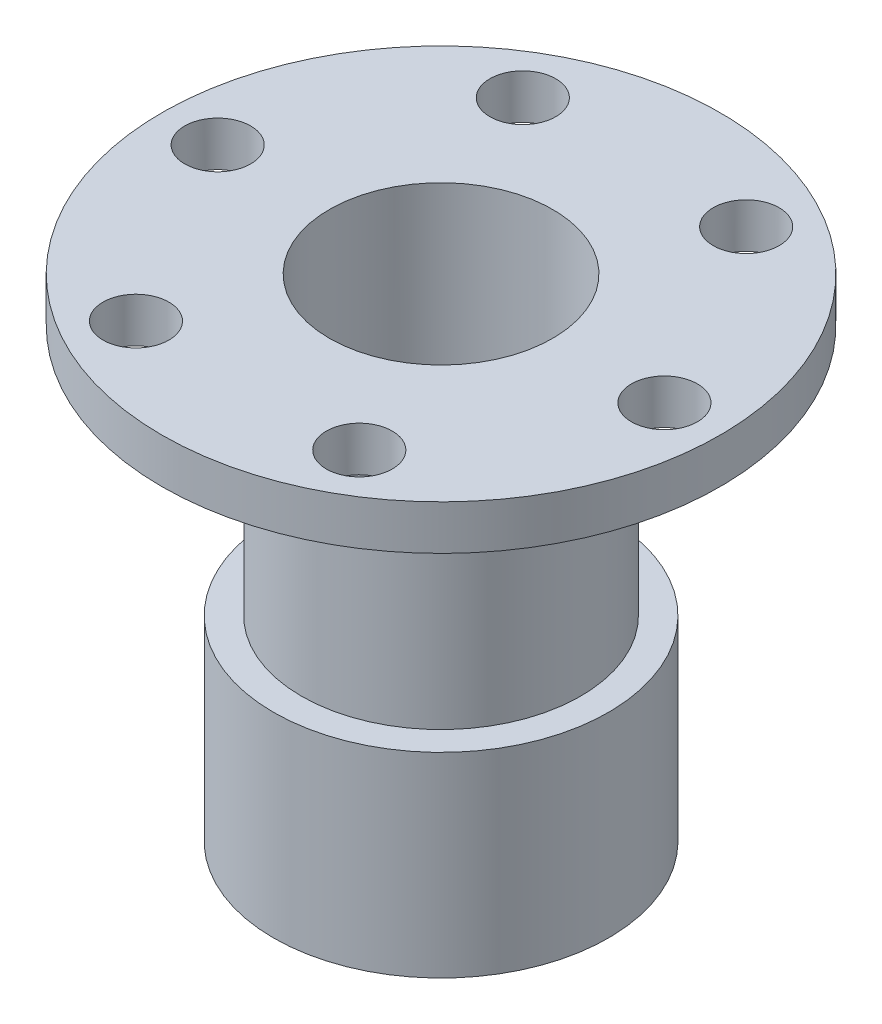
ISO-10303-21;
HEADER;
FILE_DESCRIPTION(('STEP AP214'),'2;1');
FILE_NAME('part.step','',(''),(''),'','','');
FILE_SCHEMA(('AUTOMOTIVE_DESIGN { 1 0 10303 214 1 1 1 1 }'));
ENDSEC;
DATA;
#1=APPLICATION_CONTEXT('core data for automotive mechanical design processes');
#2=APPLICATION_PROTOCOL_DEFINITION('international standard','automotive_design',2000,#1);
#3=PRODUCT_CONTEXT('',#1,'mechanical');
#4=PRODUCT('Part','Part','',(#3));
#5=PRODUCT_RELATED_PRODUCT_CATEGORY('part','',(#4));
#6=PRODUCT_DEFINITION_FORMATION('','',#4);
#7=PRODUCT_DEFINITION_CONTEXT('part definition',#1,'design');
#8=PRODUCT_DEFINITION('design','',#6,#7);
#9=PRODUCT_DEFINITION_SHAPE('','',#8);
#10=(LENGTH_UNIT() NAMED_UNIT(*) SI_UNIT(.MILLI.,.METRE.));
#11=(NAMED_UNIT(*) PLANE_ANGLE_UNIT() SI_UNIT($,.RADIAN.));
#12=(NAMED_UNIT(*) SI_UNIT($,.STERADIAN.) SOLID_ANGLE_UNIT());
#13=UNCERTAINTY_MEASURE_WITH_UNIT(LENGTH_MEASURE(1.E-05),#10,'distance_accuracy_value','');
#14=(GEOMETRIC_REPRESENTATION_CONTEXT(3) GLOBAL_UNCERTAINTY_ASSIGNED_CONTEXT((#13)) GLOBAL_UNIT_ASSIGNED_CONTEXT((#10,
#11,#12)) REPRESENTATION_CONTEXT('',''));
#15=CARTESIAN_POINT('',(0.,0.,0.));
#16=DIRECTION('',(0.,0.,1.));
#17=DIRECTION('',(1.,0.,0.));
#18=AXIS2_PLACEMENT_3D('',#15,#16,#17);
#19=CARTESIAN_POINT('',(0.,35.,0.));
#20=DIRECTION('',(0.,-1.,0.));
#21=DIRECTION('',(0.,0.,-1.));
#22=AXIS2_PLACEMENT_3D('',#19,#20,#21);
#23=CYLINDRICAL_SURFACE('',#22,30.);
#24=CARTESIAN_POINT('',(0.,35.,0.));
#25=DIRECTION('',(0.,1.,0.));
#26=DIRECTION('',(0.,0.,1.));
#27=AXIS2_PLACEMENT_3D('',#24,#25,#26);
#28=CIRCLE('',#27,30.);
#29=CARTESIAN_POINT('',(0.,35.,30.));
#30=VERTEX_POINT('',#29);
#31=EDGE_CURVE('E10',#30,#30,#28,.T.);
#32=ORIENTED_EDGE('',*,*,#31,.F.);
#33=EDGE_LOOP('',(#32));
#34=FACE_BOUND('',#33,.T.);
#35=CARTESIAN_POINT('',(0.,0.,0.));
#36=DIRECTION('',(0.,1.,0.));
#37=DIRECTION('',(0.,0.,1.));
#38=AXIS2_PLACEMENT_3D('',#35,#36,#37);
#39=CIRCLE('',#38,30.);
#40=CARTESIAN_POINT('',(0.,0.,30.));
#41=VERTEX_POINT('',#40);
#42=EDGE_CURVE('E40',#41,#41,#39,.T.);
#43=ORIENTED_EDGE('',*,*,#42,.T.);
#44=EDGE_LOOP('',(#43));
#45=FACE_BOUND('',#44,.T.);
#46=ADVANCED_FACE('F33',(#34,#45),#23,.T.);
#47=CARTESIAN_POINT('',(0.,35.,0.));
#48=DIRECTION('',(0.,1.,0.));
#49=DIRECTION('',(0.,0.,1.));
#50=AXIS2_PLACEMENT_3D('',#47,#48,#49);
#51=PLANE('',#50);
#52=CARTESIAN_POINT('',(0.,35.,0.));
#53=DIRECTION('',(0.,1.,0.));
#54=DIRECTION('',(0.,0.,1.));
#55=AXIS2_PLACEMENT_3D('',#52,#53,#54);
#56=CIRCLE('',#55,25.);
#57=CARTESIAN_POINT('',(0.,35.,25.));
#58=VERTEX_POINT('',#57);
#59=EDGE_CURVE('E48',#58,#58,#56,.T.);
#60=ORIENTED_EDGE('',*,*,#59,.F.);
#61=EDGE_LOOP('',(#60));
#62=FACE_BOUND('',#61,.T.);
#63=ORIENTED_EDGE('',*,*,#31,.T.);
#64=EDGE_LOOP('',(#63));
#65=FACE_BOUND('',#64,.T.);
#66=ADVANCED_FACE('F107',(#62,#65),#51,.T.);
#67=CARTESIAN_POINT('',(0.,0.,0.));
#68=DIRECTION('',(0.,1.,0.));
#69=DIRECTION('',(0.,0.,1.));
#70=AXIS2_PLACEMENT_3D('',#67,#68,#69);
#71=PLANE('',#70);
#72=CARTESIAN_POINT('',(0.,0.,0.));
#73=DIRECTION('',(0.,-1.,0.));
#74=DIRECTION('',(0.,0.,-1.));
#75=AXIS2_PLACEMENT_3D('',#72,#73,#74);
#76=CIRCLE('',#75,25.);
#77=CARTESIAN_POINT('',(0.,0.,-25.));
#78=VERTEX_POINT('',#77);
#79=EDGE_CURVE('E86',#78,#78,#76,.T.);
#80=ORIENTED_EDGE('',*,*,#79,.F.);
#81=EDGE_LOOP('',(#80));
#82=FACE_BOUND('',#81,.T.);
#83=ORIENTED_EDGE('',*,*,#42,.F.);
#84=EDGE_LOOP('',(#83));
#85=FACE_BOUND('',#84,.T.);
#86=ADVANCED_FACE('F109',(#82,#85),#71,.F.);
#87=CARTESIAN_POINT('',(0.,80.,0.));
#88=DIRECTION('',(0.,-1.,0.));
#89=DIRECTION('',(0.,0.,-1.));
#90=AXIS2_PLACEMENT_3D('',#87,#88,#89);
#91=CYLINDRICAL_SURFACE('',#90,25.);
#92=CARTESIAN_POINT('',(0.,80.,0.));
#93=DIRECTION('',(0.,1.,0.));
#94=DIRECTION('',(0.,0.,1.));
#95=AXIS2_PLACEMENT_3D('',#92,#93,#94);
#96=CIRCLE('',#95,25.);
#97=CARTESIAN_POINT('',(0.,80.,25.));
#98=VERTEX_POINT('',#97);
#99=EDGE_CURVE('E45',#98,#98,#96,.T.);
#100=ORIENTED_EDGE('',*,*,#99,.F.);
#101=EDGE_LOOP('',(#100));
#102=FACE_BOUND('',#101,.T.);
#103=ORIENTED_EDGE('',*,*,#59,.T.);
#104=EDGE_LOOP('',(#103));
#105=FACE_BOUND('',#104,.T.);
#106=ADVANCED_FACE('F105',(#102,#105),#91,.T.);
#107=CARTESIAN_POINT('',(0.,88.,0.));
#108=DIRECTION('',(0.,-1.,0.));
#109=DIRECTION('',(0.,0.,-1.));
#110=AXIS2_PLACEMENT_3D('',#107,#108,#109);
#111=CYLINDRICAL_SURFACE('',#110,50.);
#112=CARTESIAN_POINT('',(0.,88.,0.));
#113=DIRECTION('',(0.,1.,0.));
#114=DIRECTION('',(0.,0.,1.));
#115=AXIS2_PLACEMENT_3D('',#112,#113,#114);
#116=CIRCLE('',#115,50.);
#117=CARTESIAN_POINT('',(0.,88.,50.));
#118=VERTEX_POINT('',#117);
#119=EDGE_CURVE('E95',#118,#118,#116,.T.);
#120=ORIENTED_EDGE('',*,*,#119,.F.);
#121=EDGE_LOOP('',(#120));
#122=FACE_BOUND('',#121,.T.);
#123=CARTESIAN_POINT('',(0.,80.,0.));
#124=DIRECTION('',(0.,1.,0.));
#125=DIRECTION('',(0.,0.,1.));
#126=AXIS2_PLACEMENT_3D('',#123,#124,#125);
#127=CIRCLE('',#126,50.);
#128=CARTESIAN_POINT('',(0.,80.,50.));
#129=VERTEX_POINT('',#128);
#130=EDGE_CURVE('E92',#129,#129,#127,.T.);
#131=ORIENTED_EDGE('',*,*,#130,.T.);
#132=EDGE_LOOP('',(#131));
#133=FACE_BOUND('',#132,.T.);
#134=ADVANCED_FACE('F120',(#122,#133),#111,.T.);
#135=CARTESIAN_POINT('',(0.,88.,0.));
#136=DIRECTION('',(0.,1.,0.));
#137=DIRECTION('',(0.,0.,1.));
#138=AXIS2_PLACEMENT_3D('',#135,#136,#137);
#139=PLANE('',#138);
#140=CARTESIAN_POINT('',(-20.0000000000002,88.,34.6410161513775));
#141=DIRECTION('',(0.,1.,0.));
#142=DIRECTION('',(-0.866025403784436,0.,-0.500000000000004));
#143=AXIS2_PLACEMENT_3D('',#140,#141,#142);
#144=CIRCLE('',#143,5.9);
#145=CARTESIAN_POINT('',(-25.1095498823283,88.,31.6910161513774));
#146=VERTEX_POINT('',#145);
#147=EDGE_CURVE('E64',#146,#146,#144,.T.);
#148=ORIENTED_EDGE('',*,*,#147,.F.);
#149=EDGE_LOOP('',(#148));
#150=FACE_BOUND('',#149,.T.);
#151=CARTESIAN_POINT('',(-40.,88.,0.));
#152=DIRECTION('',(0.,1.,0.));
#153=DIRECTION('',(0.,0.,-1.));
#154=AXIS2_PLACEMENT_3D('',#151,#152,#153);
#155=CIRCLE('',#154,5.9);
#156=CARTESIAN_POINT('',(-40.,88.,-5.9));
#157=VERTEX_POINT('',#156);
#158=EDGE_CURVE('E171',#157,#157,#155,.T.);
#159=ORIENTED_EDGE('',*,*,#158,.F.);
#160=EDGE_LOOP('',(#159));
#161=FACE_BOUND('',#160,.T.);
#162=CARTESIAN_POINT('',(-19.9999999999997,88.,-34.6410161513777));
#163=DIRECTION('',(0.,1.,0.));
#164=DIRECTION('',(0.866025403784443,0.,-0.499999999999992));
#165=AXIS2_PLACEMENT_3D('',#162,#163,#164);
#166=CIRCLE('',#165,5.9);
#167=CARTESIAN_POINT('',(-14.8904501176715,88.,-37.5910161513777));
#168=VERTEX_POINT('',#167);
#169=EDGE_CURVE('E174',#168,#168,#166,.T.);
#170=ORIENTED_EDGE('',*,*,#169,.F.);
#171=EDGE_LOOP('',(#170));
#172=FACE_BOUND('',#171,.T.);
#173=CARTESIAN_POINT('',(20.0000000000004,88.,-34.6410161513773));
#174=DIRECTION('',(0.,1.,0.));
#175=DIRECTION('',(0.866025403784433,0.,0.50000000000001));
#176=AXIS2_PLACEMENT_3D('',#173,#174,#175);
#177=CIRCLE('',#176,5.9);
#178=CARTESIAN_POINT('',(25.1095498823286,88.,-31.6910161513773));
#179=VERTEX_POINT('',#178);
#180=EDGE_CURVE('E79',#179,#179,#177,.T.);
#181=ORIENTED_EDGE('',*,*,#180,.F.);
#182=EDGE_LOOP('',(#181));
#183=FACE_BOUND('',#182,.T.);
#184=CARTESIAN_POINT('',(19.9999999999999,88.,34.6410161513776));
#185=DIRECTION('',(0.,1.,0.));
#186=DIRECTION('',(-0.86602540378444,0.,0.499999999999998));
#187=AXIS2_PLACEMENT_3D('',#184,#185,#186);
#188=CIRCLE('',#187,5.9);
#189=CARTESIAN_POINT('',(14.8904501176717,88.,37.5910161513776));
#190=VERTEX_POINT('',#189);
#191=EDGE_CURVE('E59',#190,#190,#188,.T.);
#192=ORIENTED_EDGE('',*,*,#191,.F.);
#193=EDGE_LOOP('',(#192));
#194=FACE_BOUND('',#193,.T.);
#195=CARTESIAN_POINT('',(40.,88.,0.));
#196=DIRECTION('',(0.,1.,0.));
#197=DIRECTION('',(0.,0.,1.));
#198=AXIS2_PLACEMENT_3D('',#195,#196,#197);
#199=CIRCLE('',#198,5.9);
#200=CARTESIAN_POINT('',(40.,88.,5.9));
#201=VERTEX_POINT('',#200);
#202=EDGE_CURVE('E55',#201,#201,#199,.T.);
#203=ORIENTED_EDGE('',*,*,#202,.F.);
#204=EDGE_LOOP('',(#203));
#205=FACE_BOUND('',#204,.T.);
#206=CARTESIAN_POINT('',(0.,88.,0.));
#207=DIRECTION('',(0.,1.,0.));
#208=DIRECTION('',(0.,0.,1.));
#209=AXIS2_PLACEMENT_3D('',#206,#207,#208);
#210=CIRCLE('',#209,20.);
#211=CARTESIAN_POINT('',(0.,88.,20.));
#212=VERTEX_POINT('',#211);
#213=EDGE_CURVE('E83',#212,#212,#210,.T.);
#214=ORIENTED_EDGE('',*,*,#213,.F.);
#215=EDGE_LOOP('',(#214));
#216=FACE_BOUND('',#215,.T.);
#217=ORIENTED_EDGE('',*,*,#119,.T.);
#218=EDGE_LOOP('',(#217));
#219=FACE_BOUND('',#218,.T.);
#220=ADVANCED_FACE('F124',(#150,#161,#172,#183,#194,#205,#216,#219),#139,.T.);
#221=CARTESIAN_POINT('',(0.,80.,0.));
#222=DIRECTION('',(0.,1.,0.));
#223=DIRECTION('',(0.,0.,1.));
#224=AXIS2_PLACEMENT_3D('',#221,#222,#223);
#225=PLANE('',#224);
#226=CARTESIAN_POINT('',(-20.0000000000002,80.,34.6410161513775));
#227=DIRECTION('',(0.,1.,0.));
#228=DIRECTION('',(0.,0.,1.));
#229=AXIS2_PLACEMENT_3D('',#226,#227,#228);
#230=CIRCLE('',#229,5.9);
#231=CARTESIAN_POINT('',(-20.0000000000002,80.,40.5410161513775));
#232=VERTEX_POINT('',#231);
#233=EDGE_CURVE('E36',#232,#232,#230,.T.);
#234=ORIENTED_EDGE('',*,*,#233,.T.);
#235=EDGE_LOOP('',(#234));
#236=FACE_BOUND('',#235,.T.);
#237=CARTESIAN_POINT('',(-40.,80.,0.));
#238=DIRECTION('',(0.,1.,0.));
#239=DIRECTION('',(0.,0.,1.));
#240=AXIS2_PLACEMENT_3D('',#237,#238,#239);
#241=CIRCLE('',#240,5.9);
#242=CARTESIAN_POINT('',(-40.,80.,5.9));
#243=VERTEX_POINT('',#242);
#244=EDGE_CURVE('E66',#243,#243,#241,.T.);
#245=ORIENTED_EDGE('',*,*,#244,.T.);
#246=EDGE_LOOP('',(#245));
#247=FACE_BOUND('',#246,.T.);
#248=CARTESIAN_POINT('',(-19.9999999999997,80.,-34.6410161513777));
#249=DIRECTION('',(0.,1.,0.));
#250=DIRECTION('',(0.,0.,1.));
#251=AXIS2_PLACEMENT_3D('',#248,#249,#250);
#252=CIRCLE('',#251,5.9);
#253=CARTESIAN_POINT('',(-19.9999999999997,80.,-28.7410161513777));
#254=VERTEX_POINT('',#253);
#255=EDGE_CURVE('E63',#254,#254,#252,.T.);
#256=ORIENTED_EDGE('',*,*,#255,.T.);
#257=EDGE_LOOP('',(#256));
#258=FACE_BOUND('',#257,.T.);
#259=CARTESIAN_POINT('',(20.0000000000004,80.,-34.6410161513773));
#260=DIRECTION('',(0.,1.,0.));
#261=DIRECTION('',(0.,0.,1.));
#262=AXIS2_PLACEMENT_3D('',#259,#260,#261);
#263=CIRCLE('',#262,5.9);
#264=CARTESIAN_POINT('',(20.0000000000004,80.,-28.7410161513773));
#265=VERTEX_POINT('',#264);
#266=EDGE_CURVE('E60',#265,#265,#263,.T.);
#267=ORIENTED_EDGE('',*,*,#266,.T.);
#268=EDGE_LOOP('',(#267));
#269=FACE_BOUND('',#268,.T.);
#270=CARTESIAN_POINT('',(19.9999999999999,80.,34.6410161513776));
#271=DIRECTION('',(0.,1.,0.));
#272=DIRECTION('',(0.,0.,1.));
#273=AXIS2_PLACEMENT_3D('',#270,#271,#272);
#274=CIRCLE('',#273,5.9);
#275=CARTESIAN_POINT('',(19.9999999999999,80.,40.5410161513776));
#276=VERTEX_POINT('',#275);
#277=EDGE_CURVE('E56',#276,#276,#274,.T.);
#278=ORIENTED_EDGE('',*,*,#277,.T.);
#279=EDGE_LOOP('',(#278));
#280=FACE_BOUND('',#279,.T.);
#281=CARTESIAN_POINT('',(40.,80.,0.));
#282=DIRECTION('',(0.,1.,0.));
#283=DIRECTION('',(0.,0.,1.));
#284=AXIS2_PLACEMENT_3D('',#281,#282,#283);
#285=CIRCLE('',#284,5.9);
#286=CARTESIAN_POINT('',(40.,80.,5.9));
#287=VERTEX_POINT('',#286);
#288=EDGE_CURVE('E51',#287,#287,#285,.T.);
#289=ORIENTED_EDGE('',*,*,#288,.T.);
#290=EDGE_LOOP('',(#289));
#291=FACE_BOUND('',#290,.T.);
#292=ORIENTED_EDGE('',*,*,#99,.T.);
#293=EDGE_LOOP('',(#292));
#294=FACE_BOUND('',#293,.T.);
#295=ORIENTED_EDGE('',*,*,#130,.F.);
#296=EDGE_LOOP('',(#295));
#297=FACE_BOUND('',#296,.T.);
#298=ADVANCED_FACE('F126',(#236,#247,#258,#269,#280,#291,#294,#297),#225,.F.);
#299=CARTESIAN_POINT('',(0.,25.,0.));
#300=DIRECTION('',(0.,-1.,0.));
#301=DIRECTION('',(0.,0.,-1.));
#302=AXIS2_PLACEMENT_3D('',#299,#300,#301);
#303=CYLINDRICAL_SURFACE('',#302,25.);
#304=CARTESIAN_POINT('',(0.,25.,0.));
#305=DIRECTION('',(0.,-1.,0.));
#306=DIRECTION('',(0.,0.,-1.));
#307=AXIS2_PLACEMENT_3D('',#304,#305,#306);
#308=CIRCLE('',#307,25.);
#309=CARTESIAN_POINT('',(0.,25.,-25.));
#310=VERTEX_POINT('',#309);
#311=EDGE_CURVE('E89',#310,#310,#308,.T.);
#312=ORIENTED_EDGE('',*,*,#311,.F.);
#313=EDGE_LOOP('',(#312));
#314=FACE_BOUND('',#313,.T.);
#315=ORIENTED_EDGE('',*,*,#79,.T.);
#316=EDGE_LOOP('',(#315));
#317=FACE_BOUND('',#316,.T.);
#318=ADVANCED_FACE('F129',(#314,#317),#303,.F.);
#319=CARTESIAN_POINT('',(0.,25.,0.));
#320=DIRECTION('',(0.,-1.,0.));
#321=DIRECTION('',(0.,0.,-1.));
#322=AXIS2_PLACEMENT_3D('',#319,#320,#321);
#323=PLANE('',#322);
#324=CARTESIAN_POINT('',(0.,25.,0.));
#325=DIRECTION('',(0.,-1.,0.));
#326=DIRECTION('',(0.,0.,-1.));
#327=AXIS2_PLACEMENT_3D('',#324,#325,#326);
#328=CIRCLE('',#327,20.);
#329=CARTESIAN_POINT('',(0.,25.,-20.));
#330=VERTEX_POINT('',#329);
#331=EDGE_CURVE('E54',#330,#330,#328,.F.);
#332=ORIENTED_EDGE('',*,*,#331,.T.);
#333=EDGE_LOOP('',(#332));
#334=FACE_BOUND('',#333,.T.);
#335=ORIENTED_EDGE('',*,*,#311,.T.);
#336=EDGE_LOOP('',(#335));
#337=FACE_BOUND('',#336,.T.);
#338=ADVANCED_FACE('F135',(#334,#337),#323,.T.);
#339=CARTESIAN_POINT('',(0.,-0.001000000000001,0.));
#340=DIRECTION('',(0.,1.,0.));
#341=DIRECTION('',(0.,0.,1.));
#342=AXIS2_PLACEMENT_3D('',#339,#340,#341);
#343=CYLINDRICAL_SURFACE('',#342,20.);
#344=ORIENTED_EDGE('',*,*,#331,.F.);
#345=EDGE_LOOP('',(#344));
#346=FACE_BOUND('',#345,.T.);
#347=ORIENTED_EDGE('',*,*,#213,.T.);
#348=EDGE_LOOP('',(#347));
#349=FACE_BOUND('',#348,.T.);
#350=ADVANCED_FACE('F139',(#346,#349),#343,.F.);
#351=CARTESIAN_POINT('',(40.,48.,0.));
#352=DIRECTION('',(0.,1.,0.));
#353=DIRECTION('',(0.,0.,1.));
#354=AXIS2_PLACEMENT_3D('',#351,#352,#353);
#355=CYLINDRICAL_SURFACE('',#354,5.9);
#356=ORIENTED_EDGE('',*,*,#202,.T.);
#357=EDGE_LOOP('',(#356));
#358=FACE_BOUND('',#357,.T.);
#359=ORIENTED_EDGE('',*,*,#288,.F.);
#360=EDGE_LOOP('',(#359));
#361=FACE_BOUND('',#360,.T.);
#362=ADVANCED_FACE('F143',(#358,#361),#355,.F.);
#363=CARTESIAN_POINT('',(19.9999999999999,48.,34.6410161513776));
#364=DIRECTION('',(0.,1.,0.));
#365=DIRECTION('',(0.,0.,1.));
#366=AXIS2_PLACEMENT_3D('',#363,#364,#365);
#367=CYLINDRICAL_SURFACE('',#366,5.9);
#368=ORIENTED_EDGE('',*,*,#191,.T.);
#369=EDGE_LOOP('',(#368));
#370=FACE_BOUND('',#369,.T.);
#371=ORIENTED_EDGE('',*,*,#277,.F.);
#372=EDGE_LOOP('',(#371));
#373=FACE_BOUND('',#372,.T.);
#374=ADVANCED_FACE('F147',(#370,#373),#367,.F.);
#375=CARTESIAN_POINT('',(20.0000000000004,48.,-34.6410161513773));
#376=DIRECTION('',(0.,1.,0.));
#377=DIRECTION('',(0.,0.,1.));
#378=AXIS2_PLACEMENT_3D('',#375,#376,#377);
#379=CYLINDRICAL_SURFACE('',#378,5.9);
#380=ORIENTED_EDGE('',*,*,#180,.T.);
#381=EDGE_LOOP('',(#380));
#382=FACE_BOUND('',#381,.T.);
#383=ORIENTED_EDGE('',*,*,#266,.F.);
#384=EDGE_LOOP('',(#383));
#385=FACE_BOUND('',#384,.T.);
#386=ADVANCED_FACE('F151',(#382,#385),#379,.F.);
#387=CARTESIAN_POINT('',(-19.9999999999997,48.,-34.6410161513777));
#388=DIRECTION('',(0.,1.,0.));
#389=DIRECTION('',(0.,0.,1.));
#390=AXIS2_PLACEMENT_3D('',#387,#388,#389);
#391=CYLINDRICAL_SURFACE('',#390,5.9);
#392=ORIENTED_EDGE('',*,*,#169,.T.);
#393=EDGE_LOOP('',(#392));
#394=FACE_BOUND('',#393,.T.);
#395=ORIENTED_EDGE('',*,*,#255,.F.);
#396=EDGE_LOOP('',(#395));
#397=FACE_BOUND('',#396,.T.);
#398=ADVANCED_FACE('F154',(#394,#397),#391,.F.);
#399=CARTESIAN_POINT('',(-40.,48.,0.));
#400=DIRECTION('',(0.,1.,0.));
#401=DIRECTION('',(0.,0.,1.));
#402=AXIS2_PLACEMENT_3D('',#399,#400,#401);
#403=CYLINDRICAL_SURFACE('',#402,5.9);
#404=ORIENTED_EDGE('',*,*,#158,.T.);
#405=EDGE_LOOP('',(#404));
#406=FACE_BOUND('',#405,.T.);
#407=ORIENTED_EDGE('',*,*,#244,.F.);
#408=EDGE_LOOP('',(#407));
#409=FACE_BOUND('',#408,.T.);
#410=ADVANCED_FACE('F158',(#406,#409),#403,.F.);
#411=CARTESIAN_POINT('',(-20.0000000000002,48.,34.6410161513775));
#412=DIRECTION('',(0.,1.,0.));
#413=DIRECTION('',(0.,0.,1.));
#414=AXIS2_PLACEMENT_3D('',#411,#412,#413);
#415=CYLINDRICAL_SURFACE('',#414,5.9);
#416=ORIENTED_EDGE('',*,*,#147,.T.);
#417=EDGE_LOOP('',(#416));
#418=FACE_BOUND('',#417,.T.);
#419=ORIENTED_EDGE('',*,*,#233,.F.);
#420=EDGE_LOOP('',(#419));
#421=FACE_BOUND('',#420,.T.);
#422=ADVANCED_FACE('F162',(#418,#421),#415,.F.);
#423=CLOSED_SHELL('',(#46,#66,#86,#106,#134,#220,#298,#318,#338,#350,#362,#374,#386,#398,#410,#422));
#424=MANIFOLD_SOLID_BREP('B2',#423);
#425=ADVANCED_BREP_SHAPE_REPRESENTATION('',(#18,#424),#14);
#426=SHAPE_DEFINITION_REPRESENTATION(#9,#425);
ENDSEC;
END-ISO-10303-21;
